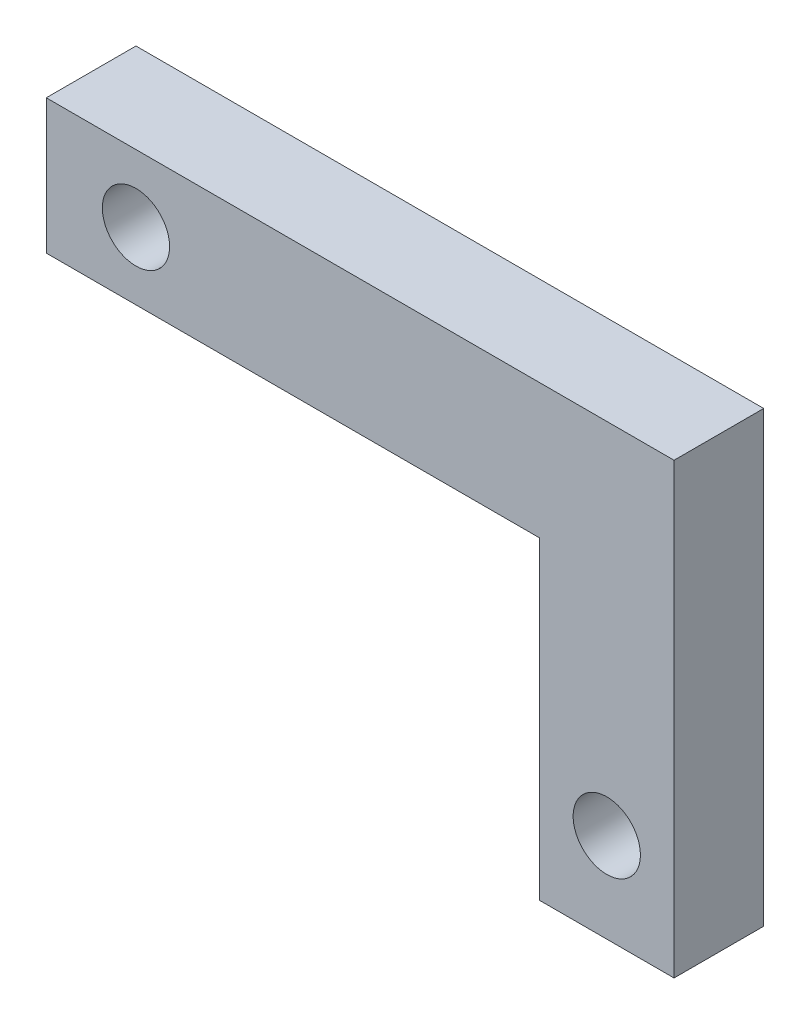
ISO-10303-21;
HEADER;
FILE_DESCRIPTION(('STEP AP214'),'2;1');
FILE_NAME('part.step','',(''),(''),'','','');
FILE_SCHEMA(('AUTOMOTIVE_DESIGN { 1 0 10303 214 1 1 1 1 }'));
ENDSEC;
DATA;
#1=APPLICATION_CONTEXT('core data for automotive mechanical design processes');
#2=APPLICATION_PROTOCOL_DEFINITION('international standard','automotive_design',2000,#1);
#3=PRODUCT_CONTEXT('',#1,'mechanical');
#4=PRODUCT('Part','Part','',(#3));
#5=PRODUCT_RELATED_PRODUCT_CATEGORY('part','',(#4));
#6=PRODUCT_DEFINITION_FORMATION('','',#4);
#7=PRODUCT_DEFINITION_CONTEXT('part definition',#1,'design');
#8=PRODUCT_DEFINITION('design','',#6,#7);
#9=PRODUCT_DEFINITION_SHAPE('','',#8);
#10=(LENGTH_UNIT() NAMED_UNIT(*) SI_UNIT(.MILLI.,.METRE.));
#11=(NAMED_UNIT(*) PLANE_ANGLE_UNIT() SI_UNIT($,.RADIAN.));
#12=(NAMED_UNIT(*) SI_UNIT($,.STERADIAN.) SOLID_ANGLE_UNIT());
#13=UNCERTAINTY_MEASURE_WITH_UNIT(LENGTH_MEASURE(1.E-05),#10,'distance_accuracy_value','');
#14=(GEOMETRIC_REPRESENTATION_CONTEXT(3) GLOBAL_UNCERTAINTY_ASSIGNED_CONTEXT((#13)) GLOBAL_UNIT_ASSIGNED_CONTEXT((#10,
#11,#12)) REPRESENTATION_CONTEXT('',''));
#15=CARTESIAN_POINT('',(0.,0.,0.));
#16=DIRECTION('',(0.,0.,1.));
#17=DIRECTION('',(1.,0.,0.));
#18=AXIS2_PLACEMENT_3D('',#15,#16,#17);
#19=CARTESIAN_POINT('',(0.,0.,25.4));
#20=DIRECTION('',(0.,1.,0.));
#21=DIRECTION('',(0.,0.,1.));
#22=AXIS2_PLACEMENT_3D('',#19,#20,#21);
#23=PLANE('',#22);
#24=DIRECTION('',(1.,0.,0.));
#25=VECTOR('',#24,1.);
#26=CARTESIAN_POINT('',(0.,0.,0.));
#27=LINE('',#26,#25);
#28=CARTESIAN_POINT('',(0.,0.,0.));
#29=VERTEX_POINT('',#28);
#30=CARTESIAN_POINT('',(139.7,0.,0.));
#31=VERTEX_POINT('',#30);
#32=EDGE_CURVE('E120',#29,#31,#27,.T.);
#33=ORIENTED_EDGE('',*,*,#32,.T.);
#34=DIRECTION('',(0.,0.,-1.));
#35=VECTOR('',#34,1.);
#36=CARTESIAN_POINT('',(139.7,0.,25.4));
#37=LINE('',#36,#35);
#38=CARTESIAN_POINT('',(139.7,0.,25.4));
#39=VERTEX_POINT('',#38);
#40=EDGE_CURVE('E11',#39,#31,#37,.T.);
#41=ORIENTED_EDGE('',*,*,#40,.F.);
#42=DIRECTION('',(1.,0.,0.));
#43=VECTOR('',#42,1.);
#44=CARTESIAN_POINT('',(0.,0.,25.4));
#45=LINE('',#44,#43);
#46=CARTESIAN_POINT('',(0.,0.,25.4));
#47=VERTEX_POINT('',#46);
#48=EDGE_CURVE('E135',#47,#39,#45,.T.);
#49=ORIENTED_EDGE('',*,*,#48,.F.);
#50=DIRECTION('',(0.,0.,-1.));
#51=VECTOR('',#50,1.);
#52=CARTESIAN_POINT('',(0.,0.,25.4));
#53=LINE('',#52,#51);
#54=EDGE_CURVE('E52',#47,#29,#53,.T.);
#55=ORIENTED_EDGE('',*,*,#54,.T.);
#56=EDGE_LOOP('',(#33,#41,#49,#55));
#57=FACE_BOUND('',#56,.T.);
#58=ADVANCED_FACE('F36',(#57),#23,.F.);
#59=CARTESIAN_POINT('',(139.7,0.,25.4));
#60=DIRECTION('',(1.,0.,0.));
#61=DIRECTION('',(0.,0.,-1.));
#62=AXIS2_PLACEMENT_3D('',#59,#60,#61);
#63=PLANE('',#62);
#64=DIRECTION('',(0.,-1.,0.));
#65=VECTOR('',#64,1.);
#66=CARTESIAN_POINT('',(139.7,0.,0.));
#67=LINE('',#66,#65);
#68=CARTESIAN_POINT('',(139.7,-88.9000000000001,0.));
#69=VERTEX_POINT('',#68);
#70=EDGE_CURVE('E122',#31,#69,#67,.T.);
#71=ORIENTED_EDGE('',*,*,#70,.T.);
#72=DIRECTION('',(0.,0.,-1.));
#73=VECTOR('',#72,1.);
#74=CARTESIAN_POINT('',(139.7,-88.9000000000001,25.4));
#75=LINE('',#74,#73);
#76=CARTESIAN_POINT('',(139.7,-88.9000000000001,25.4));
#77=VERTEX_POINT('',#76);
#78=EDGE_CURVE('E44',#77,#69,#75,.T.);
#79=ORIENTED_EDGE('',*,*,#78,.F.);
#80=DIRECTION('',(0.,-1.,0.));
#81=VECTOR('',#80,1.);
#82=CARTESIAN_POINT('',(139.7,0.,25.4));
#83=LINE('',#82,#81);
#84=EDGE_CURVE('E84',#39,#77,#83,.T.);
#85=ORIENTED_EDGE('',*,*,#84,.F.);
#86=ORIENTED_EDGE('',*,*,#40,.T.);
#87=EDGE_LOOP('',(#71,#79,#85,#86));
#88=FACE_BOUND('',#87,.T.);
#89=ADVANCED_FACE('F141',(#88),#63,.F.);
#90=CARTESIAN_POINT('',(0.,-88.9000000000001,25.4));
#91=DIRECTION('',(0.,-1.,0.));
#92=DIRECTION('',(1.,0.,0.));
#93=AXIS2_PLACEMENT_3D('',#90,#91,#92);
#94=PLANE('',#93);
#95=DIRECTION('',(-1.,0.,0.));
#96=VECTOR('',#95,1.);
#97=CARTESIAN_POINT('',(0.,-88.9000000000001,0.));
#98=LINE('',#97,#96);
#99=CARTESIAN_POINT('',(177.8,-88.9000000000001,0.));
#100=VERTEX_POINT('',#99);
#101=EDGE_CURVE('E126',#100,#69,#98,.T.);
#102=ORIENTED_EDGE('',*,*,#101,.F.);
#103=DIRECTION('',(0.,0.,-1.));
#104=VECTOR('',#103,1.);
#105=CARTESIAN_POINT('',(177.8,-88.9000000000001,25.4));
#106=LINE('',#105,#104);
#107=CARTESIAN_POINT('',(177.8,-88.9000000000001,25.4));
#108=VERTEX_POINT('',#107);
#109=EDGE_CURVE('E112',#108,#100,#106,.T.);
#110=ORIENTED_EDGE('',*,*,#109,.F.);
#111=DIRECTION('',(-1.,0.,0.));
#112=VECTOR('',#111,1.);
#113=CARTESIAN_POINT('',(0.,-88.9000000000001,25.4));
#114=LINE('',#113,#112);
#115=EDGE_CURVE('E102',#108,#77,#114,.T.);
#116=ORIENTED_EDGE('',*,*,#115,.T.);
#117=ORIENTED_EDGE('',*,*,#78,.T.);
#118=EDGE_LOOP('',(#102,#110,#116,#117));
#119=FACE_BOUND('',#118,.T.);
#120=ADVANCED_FACE('F140',(#119),#94,.T.);
#121=CARTESIAN_POINT('',(177.8,1.11022302462516E-13,25.4));
#122=DIRECTION('',(-1.,0.,0.));
#123=DIRECTION('',(0.,-1.,0.));
#124=AXIS2_PLACEMENT_3D('',#121,#122,#123);
#125=PLANE('',#124);
#126=DIRECTION('',(0.,1.,0.));
#127=VECTOR('',#126,1.);
#128=CARTESIAN_POINT('',(177.8,1.11022302462516E-13,0.));
#129=LINE('',#128,#127);
#130=CARTESIAN_POINT('',(177.8,38.1000000000001,0.));
#131=VERTEX_POINT('',#130);
#132=EDGE_CURVE('E109',#100,#131,#129,.T.);
#133=ORIENTED_EDGE('',*,*,#132,.T.);
#134=DIRECTION('',(0.,0.,-1.));
#135=VECTOR('',#134,1.);
#136=CARTESIAN_POINT('',(177.8,38.1000000000001,25.4));
#137=LINE('',#136,#135);
#138=CARTESIAN_POINT('',(177.8,38.1000000000001,25.4));
#139=VERTEX_POINT('',#138);
#140=EDGE_CURVE('E106',#139,#131,#137,.T.);
#141=ORIENTED_EDGE('',*,*,#140,.F.);
#142=DIRECTION('',(0.,1.,0.));
#143=VECTOR('',#142,1.);
#144=CARTESIAN_POINT('',(177.8,1.11022302462516E-13,25.4));
#145=LINE('',#144,#143);
#146=EDGE_CURVE('E95',#108,#139,#145,.T.);
#147=ORIENTED_EDGE('',*,*,#146,.F.);
#148=ORIENTED_EDGE('',*,*,#109,.T.);
#149=EDGE_LOOP('',(#133,#141,#147,#148));
#150=FACE_BOUND('',#149,.T.);
#151=ADVANCED_FACE('F107',(#150),#125,.F.);
#152=CARTESIAN_POINT('',(0.,38.1,25.4));
#153=DIRECTION('',(0.,1.,0.));
#154=DIRECTION('',(0.,0.,1.));
#155=AXIS2_PLACEMENT_3D('',#152,#153,#154);
#156=PLANE('',#155);
#157=DIRECTION('',(1.,0.,0.));
#158=VECTOR('',#157,1.);
#159=CARTESIAN_POINT('',(0.,38.1,0.));
#160=LINE('',#159,#158);
#161=CARTESIAN_POINT('',(0.,38.1,0.));
#162=VERTEX_POINT('',#161);
#163=EDGE_CURVE('E130',#162,#131,#160,.T.);
#164=ORIENTED_EDGE('',*,*,#163,.F.);
#165=DIRECTION('',(0.,0.,-1.));
#166=VECTOR('',#165,1.);
#167=CARTESIAN_POINT('',(0.,38.1,25.4));
#168=LINE('',#167,#166);
#169=CARTESIAN_POINT('',(0.,38.1,25.4));
#170=VERTEX_POINT('',#169);
#171=EDGE_CURVE('E72',#170,#162,#168,.T.);
#172=ORIENTED_EDGE('',*,*,#171,.F.);
#173=DIRECTION('',(1.,0.,0.));
#174=VECTOR('',#173,1.);
#175=CARTESIAN_POINT('',(0.,38.1,25.4));
#176=LINE('',#175,#174);
#177=EDGE_CURVE('E100',#170,#139,#176,.T.);
#178=ORIENTED_EDGE('',*,*,#177,.T.);
#179=ORIENTED_EDGE('',*,*,#140,.T.);
#180=EDGE_LOOP('',(#164,#172,#178,#179));
#181=FACE_BOUND('',#180,.T.);
#182=ADVANCED_FACE('F114',(#181),#156,.T.);
#183=CARTESIAN_POINT('',(0.,0.,25.4));
#184=DIRECTION('',(-1.,0.,0.));
#185=DIRECTION('',(0.,0.,1.));
#186=AXIS2_PLACEMENT_3D('',#183,#184,#185);
#187=PLANE('',#186);
#188=DIRECTION('',(0.,1.,0.));
#189=VECTOR('',#188,1.);
#190=CARTESIAN_POINT('',(0.,0.,0.));
#191=LINE('',#190,#189);
#192=EDGE_CURVE('E132',#29,#162,#191,.T.);
#193=ORIENTED_EDGE('',*,*,#192,.F.);
#194=ORIENTED_EDGE('',*,*,#54,.F.);
#195=DIRECTION('',(0.,1.,0.));
#196=VECTOR('',#195,1.);
#197=CARTESIAN_POINT('',(0.,0.,25.4));
#198=LINE('',#197,#196);
#199=EDGE_CURVE('E115',#47,#170,#198,.T.);
#200=ORIENTED_EDGE('',*,*,#199,.T.);
#201=ORIENTED_EDGE('',*,*,#171,.T.);
#202=EDGE_LOOP('',(#193,#194,#200,#201));
#203=FACE_BOUND('',#202,.T.);
#204=ADVANCED_FACE('F145',(#203),#187,.T.);
#205=CARTESIAN_POINT('',(0.,0.,25.4));
#206=DIRECTION('',(0.,0.,1.));
#207=DIRECTION('',(1.,0.,0.));
#208=AXIS2_PLACEMENT_3D('',#205,#206,#207);
#209=PLANE('',#208);
#210=CARTESIAN_POINT('',(158.75,-63.5,25.4));
#211=DIRECTION('',(0.,0.,1.));
#212=DIRECTION('',(1.,0.,0.));
#213=AXIS2_PLACEMENT_3D('',#210,#211,#212);
#214=CIRCLE('',#213,9.525);
#215=CARTESIAN_POINT('',(168.275,-63.5,25.4));
#216=VERTEX_POINT('',#215);
#217=EDGE_CURVE('E169',#216,#216,#214,.T.);
#218=ORIENTED_EDGE('',*,*,#217,.F.);
#219=EDGE_LOOP('',(#218));
#220=FACE_BOUND('',#219,.T.);
#221=CARTESIAN_POINT('',(25.4,19.05,25.4));
#222=DIRECTION('',(0.,0.,1.));
#223=DIRECTION('',(1.,0.,0.));
#224=AXIS2_PLACEMENT_3D('',#221,#222,#223);
#225=CIRCLE('',#224,9.52500000000001);
#226=CARTESIAN_POINT('',(34.925,19.05,25.4));
#227=VERTEX_POINT('',#226);
#228=EDGE_CURVE('E163',#227,#227,#225,.T.);
#229=ORIENTED_EDGE('',*,*,#228,.F.);
#230=EDGE_LOOP('',(#229));
#231=FACE_BOUND('',#230,.T.);
#232=ORIENTED_EDGE('',*,*,#48,.T.);
#233=ORIENTED_EDGE('',*,*,#84,.T.);
#234=ORIENTED_EDGE('',*,*,#115,.F.);
#235=ORIENTED_EDGE('',*,*,#146,.T.);
#236=ORIENTED_EDGE('',*,*,#177,.F.);
#237=ORIENTED_EDGE('',*,*,#199,.F.);
#238=EDGE_LOOP('',(#232,#233,#234,#235,#236,#237));
#239=FACE_BOUND('',#238,.T.);
#240=ADVANCED_FACE('F97',(#220,#231,#239),#209,.T.);
#241=CARTESIAN_POINT('',(0.,0.,0.));
#242=DIRECTION('',(0.,0.,1.));
#243=DIRECTION('',(1.,0.,0.));
#244=AXIS2_PLACEMENT_3D('',#241,#242,#243);
#245=PLANE('',#244);
#246=CARTESIAN_POINT('',(158.75,-63.5,0.));
#247=DIRECTION('',(0.,0.,1.));
#248=DIRECTION('',(1.,0.,0.));
#249=AXIS2_PLACEMENT_3D('',#246,#247,#248);
#250=CIRCLE('',#249,9.525);
#251=CARTESIAN_POINT('',(168.275,-63.5,0.));
#252=VERTEX_POINT('',#251);
#253=EDGE_CURVE('E166',#252,#252,#250,.T.);
#254=ORIENTED_EDGE('',*,*,#253,.T.);
#255=EDGE_LOOP('',(#254));
#256=FACE_BOUND('',#255,.T.);
#257=CARTESIAN_POINT('',(25.4,19.05,0.));
#258=DIRECTION('',(0.,0.,1.));
#259=DIRECTION('',(1.,0.,0.));
#260=AXIS2_PLACEMENT_3D('',#257,#258,#259);
#261=CIRCLE('',#260,9.52500000000001);
#262=CARTESIAN_POINT('',(34.925,19.05,0.));
#263=VERTEX_POINT('',#262);
#264=EDGE_CURVE('E123',#263,#263,#261,.T.);
#265=ORIENTED_EDGE('',*,*,#264,.T.);
#266=EDGE_LOOP('',(#265));
#267=FACE_BOUND('',#266,.T.);
#268=ORIENTED_EDGE('',*,*,#32,.F.);
#269=ORIENTED_EDGE('',*,*,#192,.T.);
#270=ORIENTED_EDGE('',*,*,#163,.T.);
#271=ORIENTED_EDGE('',*,*,#132,.F.);
#272=ORIENTED_EDGE('',*,*,#101,.T.);
#273=ORIENTED_EDGE('',*,*,#70,.F.);
#274=EDGE_LOOP('',(#268,#269,#270,#271,#272,#273));
#275=FACE_BOUND('',#274,.T.);
#276=ADVANCED_FACE('F144',(#256,#267,#275),#245,.F.);
#277=CARTESIAN_POINT('',(25.4,19.05,0.));
#278=DIRECTION('',(0.,0.,1.));
#279=DIRECTION('',(1.,0.,0.));
#280=AXIS2_PLACEMENT_3D('',#277,#278,#279);
#281=CYLINDRICAL_SURFACE('',#280,9.52500000000001);
#282=ORIENTED_EDGE('',*,*,#264,.F.);
#283=EDGE_LOOP('',(#282));
#284=FACE_BOUND('',#283,.T.);
#285=ORIENTED_EDGE('',*,*,#228,.T.);
#286=EDGE_LOOP('',(#285));
#287=FACE_BOUND('',#286,.T.);
#288=ADVANCED_FACE('F180',(#284,#287),#281,.F.);
#289=CARTESIAN_POINT('',(158.75,-63.5,0.));
#290=DIRECTION('',(0.,0.,1.));
#291=DIRECTION('',(1.,0.,0.));
#292=AXIS2_PLACEMENT_3D('',#289,#290,#291);
#293=CYLINDRICAL_SURFACE('',#292,9.525);
#294=ORIENTED_EDGE('',*,*,#253,.F.);
#295=EDGE_LOOP('',(#294));
#296=FACE_BOUND('',#295,.T.);
#297=ORIENTED_EDGE('',*,*,#217,.T.);
#298=EDGE_LOOP('',(#297));
#299=FACE_BOUND('',#298,.T.);
#300=ADVANCED_FACE('F177',(#296,#299),#293,.F.);
#301=CLOSED_SHELL('',(#58,#89,#120,#151,#182,#204,#240,#276,#288,#300));
#302=MANIFOLD_SOLID_BREP('B2',#301);
#303=ADVANCED_BREP_SHAPE_REPRESENTATION('',(#18,#302),#14);
#304=SHAPE_DEFINITION_REPRESENTATION(#9,#303);
ENDSEC;
END-ISO-10303-21;
